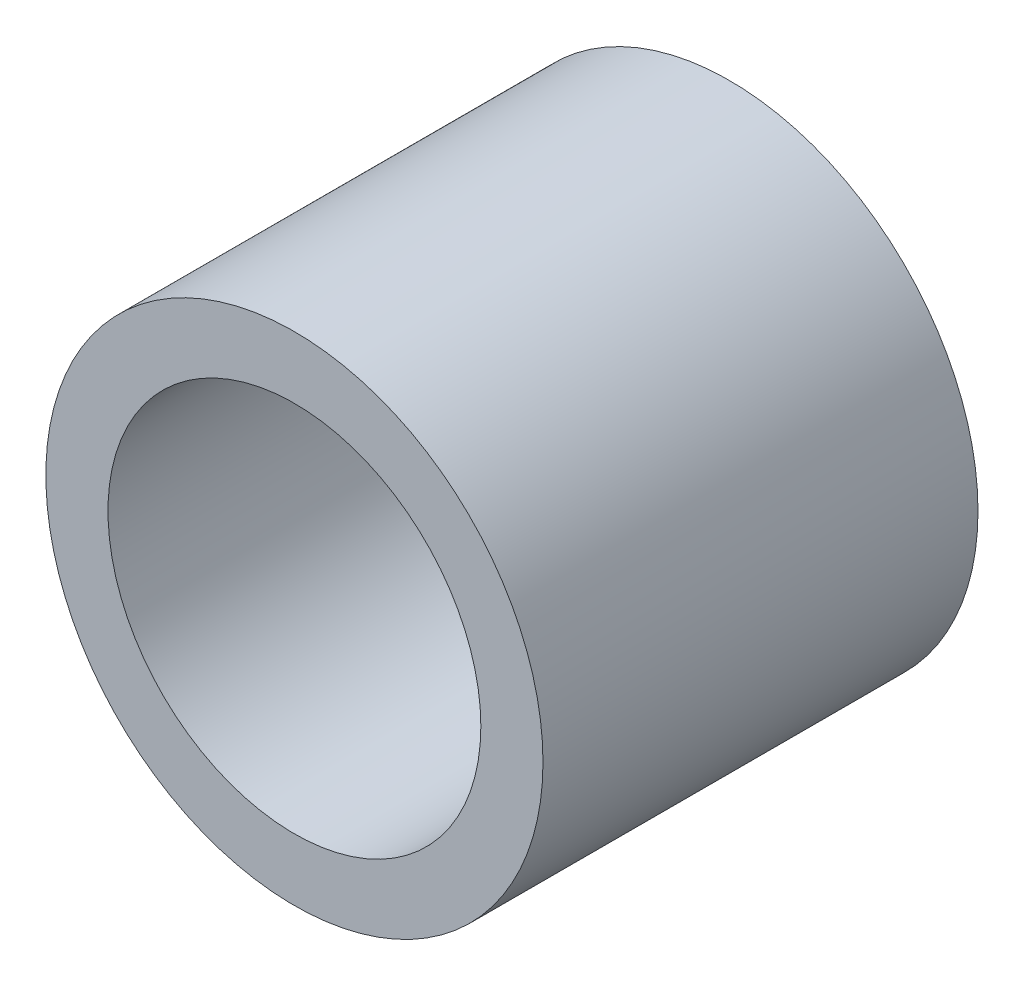
ISO-10303-21;
HEADER;
FILE_DESCRIPTION(('STEP AP214'),'2;1');
FILE_NAME('part.step','',(''),(''),'','','');
FILE_SCHEMA(('AUTOMOTIVE_DESIGN { 1 0 10303 214 1 1 1 1 }'));
ENDSEC;
DATA;
#1=APPLICATION_CONTEXT('core data for automotive mechanical design processes');
#2=APPLICATION_PROTOCOL_DEFINITION('international standard','automotive_design',2000,#1);
#3=PRODUCT_CONTEXT('',#1,'mechanical');
#4=PRODUCT('Part','Part','',(#3));
#5=PRODUCT_RELATED_PRODUCT_CATEGORY('part','',(#4));
#6=PRODUCT_DEFINITION_FORMATION('','',#4);
#7=PRODUCT_DEFINITION_CONTEXT('part definition',#1,'design');
#8=PRODUCT_DEFINITION('design','',#6,#7);
#9=PRODUCT_DEFINITION_SHAPE('','',#8);
#10=(LENGTH_UNIT() NAMED_UNIT(*) SI_UNIT(.MILLI.,.METRE.));
#11=(NAMED_UNIT(*) PLANE_ANGLE_UNIT() SI_UNIT($,.RADIAN.));
#12=(NAMED_UNIT(*) SI_UNIT($,.STERADIAN.) SOLID_ANGLE_UNIT());
#13=UNCERTAINTY_MEASURE_WITH_UNIT(LENGTH_MEASURE(1.E-05),#10,'distance_accuracy_value','');
#14=(GEOMETRIC_REPRESENTATION_CONTEXT(3) GLOBAL_UNCERTAINTY_ASSIGNED_CONTEXT((#13)) GLOBAL_UNIT_ASSIGNED_CONTEXT((#10,
#11,#12)) REPRESENTATION_CONTEXT('',''));
#15=CARTESIAN_POINT('',(0.,0.,0.));
#16=DIRECTION('',(0.,0.,1.));
#17=DIRECTION('',(1.,0.,0.));
#18=AXIS2_PLACEMENT_3D('',#15,#16,#17);
#19=CARTESIAN_POINT('',(0.,0.,3.5));
#20=DIRECTION('',(0.,0.,1.));
#21=DIRECTION('',(1.,0.,0.));
#22=AXIS2_PLACEMENT_3D('',#19,#20,#21);
#23=PLANE('',#22);
#24=CARTESIAN_POINT('',(0.,0.,3.5));
#25=DIRECTION('',(0.,0.,1.));
#26=DIRECTION('',(1.,0.,0.));
#27=AXIS2_PLACEMENT_3D('',#24,#25,#26);
#28=CIRCLE('',#27,2.);
#29=CARTESIAN_POINT('',(2.,0.,3.5));
#30=VERTEX_POINT('',#29);
#31=EDGE_CURVE('E10',#30,#30,#28,.T.);
#32=ORIENTED_EDGE('',*,*,#31,.T.);
#33=EDGE_LOOP('',(#32));
#34=FACE_BOUND('',#33,.T.);
#35=CARTESIAN_POINT('',(0.,0.,3.5));
#36=DIRECTION('',(0.,0.,1.));
#37=DIRECTION('',(1.,0.,0.));
#38=AXIS2_PLACEMENT_3D('',#35,#36,#37);
#39=CIRCLE('',#38,1.5);
#40=CARTESIAN_POINT('',(1.5,0.,3.5));
#41=VERTEX_POINT('',#40);
#42=EDGE_CURVE('E44',#41,#41,#39,.T.);
#43=ORIENTED_EDGE('',*,*,#42,.F.);
#44=EDGE_LOOP('',(#43));
#45=FACE_BOUND('',#44,.T.);
#46=ADVANCED_FACE('F33',(#34,#45),#23,.T.);
#47=CARTESIAN_POINT('',(0.,0.,0.));
#48=DIRECTION('',(0.,0.,1.));
#49=DIRECTION('',(1.,0.,0.));
#50=AXIS2_PLACEMENT_3D('',#47,#48,#49);
#51=PLANE('',#50);
#52=CARTESIAN_POINT('',(0.,0.,0.));
#53=DIRECTION('',(0.,0.,1.));
#54=DIRECTION('',(1.,0.,0.));
#55=AXIS2_PLACEMENT_3D('',#52,#53,#54);
#56=CIRCLE('',#55,2.);
#57=CARTESIAN_POINT('',(2.,0.,0.));
#58=VERTEX_POINT('',#57);
#59=EDGE_CURVE('E37',#58,#58,#56,.T.);
#60=ORIENTED_EDGE('',*,*,#59,.F.);
#61=EDGE_LOOP('',(#60));
#62=FACE_BOUND('',#61,.T.);
#63=CARTESIAN_POINT('',(0.,0.,0.));
#64=DIRECTION('',(0.,0.,1.));
#65=DIRECTION('',(1.,0.,0.));
#66=AXIS2_PLACEMENT_3D('',#63,#64,#65);
#67=CIRCLE('',#66,1.5);
#68=CARTESIAN_POINT('',(1.5,0.,0.));
#69=VERTEX_POINT('',#68);
#70=EDGE_CURVE('E46',#69,#69,#67,.T.);
#71=ORIENTED_EDGE('',*,*,#70,.T.);
#72=EDGE_LOOP('',(#71));
#73=FACE_BOUND('',#72,.T.);
#74=ADVANCED_FACE('F56',(#62,#73),#51,.F.);
#75=CARTESIAN_POINT('',(0.,0.,3.5));
#76=DIRECTION('',(0.,0.,-1.));
#77=DIRECTION('',(-1.,0.,0.));
#78=AXIS2_PLACEMENT_3D('',#75,#76,#77);
#79=CYLINDRICAL_SURFACE('',#78,2.);
#80=ORIENTED_EDGE('',*,*,#31,.F.);
#81=EDGE_LOOP('',(#80));
#82=FACE_BOUND('',#81,.T.);
#83=ORIENTED_EDGE('',*,*,#59,.T.);
#84=EDGE_LOOP('',(#83));
#85=FACE_BOUND('',#84,.T.);
#86=ADVANCED_FACE('F35',(#82,#85),#79,.T.);
#87=CARTESIAN_POINT('',(0.,0.,3.5));
#88=DIRECTION('',(0.,0.,-1.));
#89=DIRECTION('',(-1.,0.,0.));
#90=AXIS2_PLACEMENT_3D('',#87,#88,#89);
#91=CYLINDRICAL_SURFACE('',#90,1.5);
#92=ORIENTED_EDGE('',*,*,#42,.T.);
#93=EDGE_LOOP('',(#92));
#94=FACE_BOUND('',#93,.T.);
#95=ORIENTED_EDGE('',*,*,#70,.F.);
#96=EDGE_LOOP('',(#95));
#97=FACE_BOUND('',#96,.T.);
#98=ADVANCED_FACE('F52',(#94,#97),#91,.F.);
#99=CLOSED_SHELL('',(#46,#74,#86,#98));
#100=MANIFOLD_SOLID_BREP('B2',#99);
#101=ADVANCED_BREP_SHAPE_REPRESENTATION('',(#18,#100),#14);
#102=SHAPE_DEFINITION_REPRESENTATION(#9,#101);
ENDSEC;
END-ISO-10303-21;
